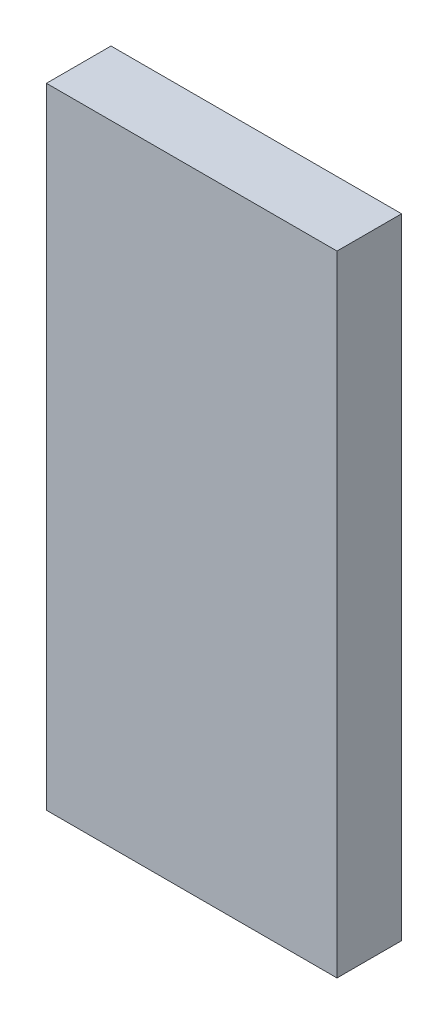
ISO-10303-21;
HEADER;
FILE_DESCRIPTION(('STEP AP214'),'2;1');
FILE_NAME('part.step','',(''),(''),'','','');
FILE_SCHEMA(('AUTOMOTIVE_DESIGN { 1 0 10303 214 1 1 1 1 }'));
ENDSEC;
DATA;
#1=APPLICATION_CONTEXT('core data for automotive mechanical design processes');
#2=APPLICATION_PROTOCOL_DEFINITION('international standard','automotive_design',2000,#1);
#3=PRODUCT_CONTEXT('',#1,'mechanical');
#4=PRODUCT('Part','Part','',(#3));
#5=PRODUCT_RELATED_PRODUCT_CATEGORY('part','',(#4));
#6=PRODUCT_DEFINITION_FORMATION('','',#4);
#7=PRODUCT_DEFINITION_CONTEXT('part definition',#1,'design');
#8=PRODUCT_DEFINITION('design','',#6,#7);
#9=PRODUCT_DEFINITION_SHAPE('','',#8);
#10=(LENGTH_UNIT() NAMED_UNIT(*) SI_UNIT(.MILLI.,.METRE.));
#11=(NAMED_UNIT(*) PLANE_ANGLE_UNIT() SI_UNIT($,.RADIAN.));
#12=(NAMED_UNIT(*) SI_UNIT($,.STERADIAN.) SOLID_ANGLE_UNIT());
#13=UNCERTAINTY_MEASURE_WITH_UNIT(LENGTH_MEASURE(1.E-05),#10,'distance_accuracy_value','');
#14=(GEOMETRIC_REPRESENTATION_CONTEXT(3) GLOBAL_UNCERTAINTY_ASSIGNED_CONTEXT((#13)) GLOBAL_UNIT_ASSIGNED_CONTEXT((#10,
#11,#12)) REPRESENTATION_CONTEXT('',''));
#15=CARTESIAN_POINT('',(0.,0.,0.));
#16=DIRECTION('',(0.,0.,1.));
#17=DIRECTION('',(1.,0.,0.));
#18=AXIS2_PLACEMENT_3D('',#15,#16,#17);
#19=CARTESIAN_POINT('',(18.,0.,4.));
#20=DIRECTION('',(0.,1.,0.));
#21=DIRECTION('',(-1.,0.,0.));
#22=AXIS2_PLACEMENT_3D('',#19,#20,#21);
#23=PLANE('',#22);
#24=DIRECTION('',(1.,0.,0.));
#25=VECTOR('',#24,1.);
#26=CARTESIAN_POINT('',(18.,0.,0.));
#27=LINE('',#26,#25);
#28=CARTESIAN_POINT('',(0.,0.,0.));
#29=VERTEX_POINT('',#28);
#30=CARTESIAN_POINT('',(18.,0.,0.));
#31=VERTEX_POINT('',#30);
#32=EDGE_CURVE('E96',#29,#31,#27,.T.);
#33=ORIENTED_EDGE('',*,*,#32,.T.);
#34=DIRECTION('',(0.,0.,-1.));
#35=VECTOR('',#34,1.);
#36=CARTESIAN_POINT('',(18.,0.,4.));
#37=LINE('',#36,#35);
#38=CARTESIAN_POINT('',(18.,0.,4.));
#39=VERTEX_POINT('',#38);
#40=EDGE_CURVE('E11',#39,#31,#37,.T.);
#41=ORIENTED_EDGE('',*,*,#40,.F.);
#42=DIRECTION('',(1.,0.,0.));
#43=VECTOR('',#42,1.);
#44=CARTESIAN_POINT('',(18.,0.,4.));
#45=LINE('',#44,#43);
#46=CARTESIAN_POINT('',(0.,0.,4.));
#47=VERTEX_POINT('',#46);
#48=EDGE_CURVE('E84',#47,#39,#45,.T.);
#49=ORIENTED_EDGE('',*,*,#48,.F.);
#50=DIRECTION('',(0.,0.,-1.));
#51=VECTOR('',#50,1.);
#52=CARTESIAN_POINT('',(0.,0.,4.));
#53=LINE('',#52,#51);
#54=EDGE_CURVE('E92',#47,#29,#53,.T.);
#55=ORIENTED_EDGE('',*,*,#54,.T.);
#56=EDGE_LOOP('',(#33,#41,#49,#55));
#57=FACE_BOUND('',#56,.T.);
#58=ADVANCED_FACE('F33',(#57),#23,.F.);
#59=CARTESIAN_POINT('',(18.,39.,4.));
#60=DIRECTION('',(-1.,0.,0.));
#61=DIRECTION('',(0.,-1.,0.));
#62=AXIS2_PLACEMENT_3D('',#59,#60,#61);
#63=PLANE('',#62);
#64=DIRECTION('',(0.,1.,0.));
#65=VECTOR('',#64,1.);
#66=CARTESIAN_POINT('',(18.,39.,0.));
#67=LINE('',#66,#65);
#68=CARTESIAN_POINT('',(18.,39.,0.));
#69=VERTEX_POINT('',#68);
#70=EDGE_CURVE('E88',#31,#69,#67,.T.);
#71=ORIENTED_EDGE('',*,*,#70,.T.);
#72=DIRECTION('',(0.,0.,-1.));
#73=VECTOR('',#72,1.);
#74=CARTESIAN_POINT('',(18.,39.,4.));
#75=LINE('',#74,#73);
#76=CARTESIAN_POINT('',(18.,39.,4.));
#77=VERTEX_POINT('',#76);
#78=EDGE_CURVE('E41',#77,#69,#75,.T.);
#79=ORIENTED_EDGE('',*,*,#78,.F.);
#80=DIRECTION('',(0.,1.,0.));
#81=VECTOR('',#80,1.);
#82=CARTESIAN_POINT('',(18.,39.,4.));
#83=LINE('',#82,#81);
#84=EDGE_CURVE('E79',#39,#77,#83,.T.);
#85=ORIENTED_EDGE('',*,*,#84,.F.);
#86=ORIENTED_EDGE('',*,*,#40,.T.);
#87=EDGE_LOOP('',(#71,#79,#85,#86));
#88=FACE_BOUND('',#87,.T.);
#89=ADVANCED_FACE('F87',(#88),#63,.F.);
#90=CARTESIAN_POINT('',(0.,39.,4.));
#91=DIRECTION('',(0.,-1.,0.));
#92=DIRECTION('',(0.,0.,-1.));
#93=AXIS2_PLACEMENT_3D('',#90,#91,#92);
#94=PLANE('',#93);
#95=DIRECTION('',(-1.,0.,0.));
#96=VECTOR('',#95,1.);
#97=CARTESIAN_POINT('',(0.,39.,0.));
#98=LINE('',#97,#96);
#99=CARTESIAN_POINT('',(0.,39.,0.));
#100=VERTEX_POINT('',#99);
#101=EDGE_CURVE('E66',#69,#100,#98,.T.);
#102=ORIENTED_EDGE('',*,*,#101,.T.);
#103=DIRECTION('',(0.,0.,-1.));
#104=VECTOR('',#103,1.);
#105=CARTESIAN_POINT('',(0.,39.,4.));
#106=LINE('',#105,#104);
#107=CARTESIAN_POINT('',(0.,39.,4.));
#108=VERTEX_POINT('',#107);
#109=EDGE_CURVE('E89',#108,#100,#106,.T.);
#110=ORIENTED_EDGE('',*,*,#109,.F.);
#111=DIRECTION('',(-1.,0.,0.));
#112=VECTOR('',#111,1.);
#113=CARTESIAN_POINT('',(0.,39.,4.));
#114=LINE('',#113,#112);
#115=EDGE_CURVE('E82',#77,#108,#114,.T.);
#116=ORIENTED_EDGE('',*,*,#115,.F.);
#117=ORIENTED_EDGE('',*,*,#78,.T.);
#118=EDGE_LOOP('',(#102,#110,#116,#117));
#119=FACE_BOUND('',#118,.T.);
#120=ADVANCED_FACE('F90',(#119),#94,.F.);
#121=CARTESIAN_POINT('',(0.,0.,4.));
#122=DIRECTION('',(1.,0.,0.));
#123=DIRECTION('',(0.,0.,-1.));
#124=AXIS2_PLACEMENT_3D('',#121,#122,#123);
#125=PLANE('',#124);
#126=DIRECTION('',(0.,-1.,0.));
#127=VECTOR('',#126,1.);
#128=CARTESIAN_POINT('',(0.,0.,0.));
#129=LINE('',#128,#127);
#130=EDGE_CURVE('E72',#100,#29,#129,.T.);
#131=ORIENTED_EDGE('',*,*,#130,.T.);
#132=ORIENTED_EDGE('',*,*,#54,.F.);
#133=DIRECTION('',(0.,-1.,0.));
#134=VECTOR('',#133,1.);
#135=CARTESIAN_POINT('',(0.,0.,4.));
#136=LINE('',#135,#134);
#137=EDGE_CURVE('E49',#108,#47,#136,.T.);
#138=ORIENTED_EDGE('',*,*,#137,.F.);
#139=ORIENTED_EDGE('',*,*,#109,.T.);
#140=EDGE_LOOP('',(#131,#132,#138,#139));
#141=FACE_BOUND('',#140,.T.);
#142=ADVANCED_FACE('F103',(#141),#125,.F.);
#143=CARTESIAN_POINT('',(0.,0.,4.));
#144=DIRECTION('',(0.,0.,-1.));
#145=DIRECTION('',(-1.,0.,0.));
#146=AXIS2_PLACEMENT_3D('',#143,#144,#145);
#147=PLANE('',#146);
#148=ORIENTED_EDGE('',*,*,#48,.T.);
#149=ORIENTED_EDGE('',*,*,#84,.T.);
#150=ORIENTED_EDGE('',*,*,#115,.T.);
#151=ORIENTED_EDGE('',*,*,#137,.T.);
#152=EDGE_LOOP('',(#148,#149,#150,#151));
#153=FACE_BOUND('',#152,.T.);
#154=ADVANCED_FACE('F80',(#153),#147,.F.);
#155=CARTESIAN_POINT('',(0.,0.,0.));
#156=DIRECTION('',(0.,0.,-1.));
#157=DIRECTION('',(-1.,0.,0.));
#158=AXIS2_PLACEMENT_3D('',#155,#156,#157);
#159=PLANE('',#158);
#160=ORIENTED_EDGE('',*,*,#32,.F.);
#161=ORIENTED_EDGE('',*,*,#130,.F.);
#162=ORIENTED_EDGE('',*,*,#101,.F.);
#163=ORIENTED_EDGE('',*,*,#70,.F.);
#164=EDGE_LOOP('',(#160,#161,#162,#163));
#165=FACE_BOUND('',#164,.T.);
#166=ADVANCED_FACE('F106',(#165),#159,.T.);
#167=CLOSED_SHELL('',(#58,#89,#120,#142,#154,#166));
#168=MANIFOLD_SOLID_BREP('B2',#167);
#169=ADVANCED_BREP_SHAPE_REPRESENTATION('',(#18,#168),#14);
#170=SHAPE_DEFINITION_REPRESENTATION(#9,#169);
ENDSEC;
END-ISO-10303-21;
